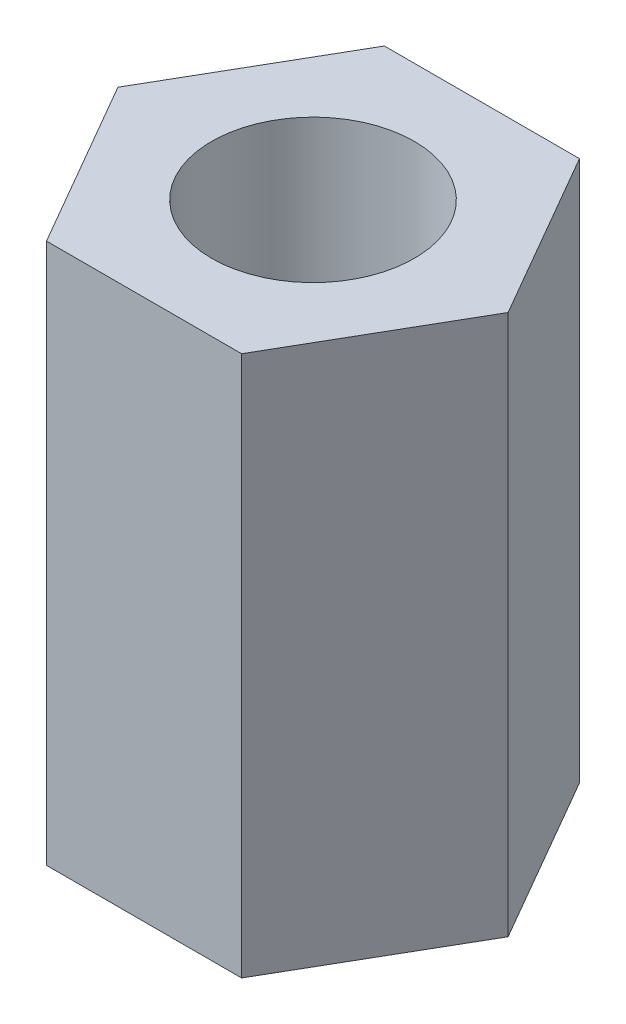
ISO-10303-21;
HEADER;
FILE_DESCRIPTION(('STEP AP214'),'2;1');
FILE_NAME('part.step','',(''),(''),'','','');
FILE_SCHEMA(('AUTOMOTIVE_DESIGN { 1 0 10303 214 1 1 1 1 }'));
ENDSEC;
DATA;
#1=APPLICATION_CONTEXT('core data for automotive mechanical design processes');
#2=APPLICATION_PROTOCOL_DEFINITION('international standard','automotive_design',2000,#1);
#3=PRODUCT_CONTEXT('',#1,'mechanical');
#4=PRODUCT('Part','Part','',(#3));
#5=PRODUCT_RELATED_PRODUCT_CATEGORY('part','',(#4));
#6=PRODUCT_DEFINITION_FORMATION('','',#4);
#7=PRODUCT_DEFINITION_CONTEXT('part definition',#1,'design');
#8=PRODUCT_DEFINITION('design','',#6,#7);
#9=PRODUCT_DEFINITION_SHAPE('','',#8);
#10=(LENGTH_UNIT() NAMED_UNIT(*) SI_UNIT(.MILLI.,.METRE.));
#11=(NAMED_UNIT(*) PLANE_ANGLE_UNIT() SI_UNIT($,.RADIAN.));
#12=(NAMED_UNIT(*) SI_UNIT($,.STERADIAN.) SOLID_ANGLE_UNIT());
#13=UNCERTAINTY_MEASURE_WITH_UNIT(LENGTH_MEASURE(1.E-05),#10,'distance_accuracy_value','');
#14=(GEOMETRIC_REPRESENTATION_CONTEXT(3) GLOBAL_UNCERTAINTY_ASSIGNED_CONTEXT((#13)) GLOBAL_UNIT_ASSIGNED_CONTEXT((#10,
#11,#12)) REPRESENTATION_CONTEXT('',''));
#15=CARTESIAN_POINT('',(0.,0.,0.));
#16=DIRECTION('',(0.,0.,1.));
#17=DIRECTION('',(1.,0.,0.));
#18=AXIS2_PLACEMENT_3D('',#15,#16,#17);
#19=CARTESIAN_POINT('',(0.,8.,2.5));
#20=DIRECTION('',(0.,0.,-1.));
#21=DIRECTION('',(-1.,0.,0.));
#22=AXIS2_PLACEMENT_3D('',#19,#20,#21);
#23=PLANE('',#22);
#24=DIRECTION('',(1.,0.,0.));
#25=VECTOR('',#24,1.);
#26=CARTESIAN_POINT('',(0.,0.,2.5));
#27=LINE('',#26,#25);
#28=CARTESIAN_POINT('',(-1.44337567297404,0.,2.50000000000001));
#29=VERTEX_POINT('',#28);
#30=CARTESIAN_POINT('',(1.44337567297409,0.,2.49999999999998));
#31=VERTEX_POINT('',#30);
#32=EDGE_CURVE('E122',#29,#31,#27,.T.);
#33=ORIENTED_EDGE('',*,*,#32,.T.);
#34=DIRECTION('',(0.,-1.,0.));
#35=VECTOR('',#34,1.);
#36=CARTESIAN_POINT('',(1.44337567297409,8.,2.49999999999998));
#37=LINE('',#36,#35);
#38=CARTESIAN_POINT('',(1.44337567297409,8.,2.49999999999998));
#39=VERTEX_POINT('',#38);
#40=EDGE_CURVE('E11',#39,#31,#37,.T.);
#41=ORIENTED_EDGE('',*,*,#40,.F.);
#42=DIRECTION('',(1.,0.,0.));
#43=VECTOR('',#42,1.);
#44=CARTESIAN_POINT('',(0.,8.,2.5));
#45=LINE('',#44,#43);
#46=CARTESIAN_POINT('',(-1.44337567297404,8.,2.50000000000001));
#47=VERTEX_POINT('',#46);
#48=EDGE_CURVE('E145',#47,#39,#45,.T.);
#49=ORIENTED_EDGE('',*,*,#48,.F.);
#50=DIRECTION('',(0.,-1.,0.));
#51=VECTOR('',#50,1.);
#52=CARTESIAN_POINT('',(-1.44337567297404,8.,2.50000000000001));
#53=LINE('',#52,#51);
#54=EDGE_CURVE('E115',#47,#29,#53,.T.);
#55=ORIENTED_EDGE('',*,*,#54,.T.);
#56=EDGE_LOOP('',(#33,#41,#49,#55));
#57=FACE_BOUND('',#56,.T.);
#58=ADVANCED_FACE('F34',(#57),#23,.F.);
#59=CARTESIAN_POINT('',(2.16506350946111,8.,1.24999999999999));
#60=DIRECTION('',(-0.866025403784442,0.,-0.499999999999995));
#61=DIRECTION('',(-0.499999999999995,0.,0.866025403784442));
#62=AXIS2_PLACEMENT_3D('',#59,#60,#61);
#63=PLANE('',#62);
#64=DIRECTION('',(0.499999999999995,0.,-0.866025403784442));
#65=VECTOR('',#64,1.);
#66=CARTESIAN_POINT('',(2.16506350946111,0.,1.24999999999999));
#67=LINE('',#66,#65);
#68=CARTESIAN_POINT('',(2.88675134594813,0.,0.));
#69=VERTEX_POINT('',#68);
#70=EDGE_CURVE('E125',#31,#69,#67,.T.);
#71=ORIENTED_EDGE('',*,*,#70,.T.);
#72=DIRECTION('',(0.,-1.,0.));
#73=VECTOR('',#72,1.);
#74=CARTESIAN_POINT('',(2.88675134594813,8.,0.));
#75=LINE('',#74,#73);
#76=CARTESIAN_POINT('',(2.88675134594813,8.,0.));
#77=VERTEX_POINT('',#76);
#78=EDGE_CURVE('E43',#77,#69,#75,.T.);
#79=ORIENTED_EDGE('',*,*,#78,.F.);
#80=DIRECTION('',(0.499999999999995,0.,-0.866025403784442));
#81=VECTOR('',#80,1.);
#82=CARTESIAN_POINT('',(2.16506350946111,8.,1.24999999999999));
#83=LINE('',#82,#81);
#84=EDGE_CURVE('E88',#39,#77,#83,.T.);
#85=ORIENTED_EDGE('',*,*,#84,.F.);
#86=ORIENTED_EDGE('',*,*,#40,.T.);
#87=EDGE_LOOP('',(#71,#79,#85,#86));
#88=FACE_BOUND('',#87,.T.);
#89=ADVANCED_FACE('F159',(#88),#63,.F.);
#90=CARTESIAN_POINT('',(2.1650635094611,8.,-1.25));
#91=DIRECTION('',(-0.866025403784438,0.,0.500000000000001));
#92=DIRECTION('',(0.500000000000001,0.,0.866025403784438));
#93=AXIS2_PLACEMENT_3D('',#90,#91,#92);
#94=PLANE('',#93);
#95=DIRECTION('',(-0.500000000000001,0.,-0.866025403784438));
#96=VECTOR('',#95,1.);
#97=CARTESIAN_POINT('',(2.1650635094611,0.,-1.25));
#98=LINE('',#97,#96);
#99=CARTESIAN_POINT('',(1.44337567297406,0.,-2.5));
#100=VERTEX_POINT('',#99);
#101=EDGE_CURVE('E127',#69,#100,#98,.T.);
#102=ORIENTED_EDGE('',*,*,#101,.T.);
#103=DIRECTION('',(0.,-1.,0.));
#104=VECTOR('',#103,1.);
#105=CARTESIAN_POINT('',(1.44337567297406,8.,-2.5));
#106=LINE('',#105,#104);
#107=CARTESIAN_POINT('',(1.44337567297406,8.,-2.5));
#108=VERTEX_POINT('',#107);
#109=EDGE_CURVE('E110',#108,#100,#106,.T.);
#110=ORIENTED_EDGE('',*,*,#109,.F.);
#111=DIRECTION('',(-0.500000000000001,0.,-0.866025403784438));
#112=VECTOR('',#111,1.);
#113=CARTESIAN_POINT('',(2.1650635094611,8.,-1.25));
#114=LINE('',#113,#112);
#115=EDGE_CURVE('E101',#77,#108,#114,.T.);
#116=ORIENTED_EDGE('',*,*,#115,.F.);
#117=ORIENTED_EDGE('',*,*,#78,.T.);
#118=EDGE_LOOP('',(#102,#110,#116,#117));
#119=FACE_BOUND('',#118,.T.);
#120=ADVANCED_FACE('F138',(#119),#94,.F.);
#121=CARTESIAN_POINT('',(0.,8.,-2.5));
#122=DIRECTION('',(0.,0.,1.));
#123=DIRECTION('',(1.,0.,0.));
#124=AXIS2_PLACEMENT_3D('',#121,#122,#123);
#125=PLANE('',#124);
#126=DIRECTION('',(-1.,0.,0.));
#127=VECTOR('',#126,1.);
#128=CARTESIAN_POINT('',(0.,0.,-2.5));
#129=LINE('',#128,#127);
#130=CARTESIAN_POINT('',(-1.44337567297408,0.,-2.49999999999999));
#131=VERTEX_POINT('',#130);
#132=EDGE_CURVE('E109',#100,#131,#129,.T.);
#133=ORIENTED_EDGE('',*,*,#132,.T.);
#134=DIRECTION('',(0.,-1.,0.));
#135=VECTOR('',#134,1.);
#136=CARTESIAN_POINT('',(-1.44337567297408,8.,-2.49999999999999));
#137=LINE('',#136,#135);
#138=CARTESIAN_POINT('',(-1.44337567297408,8.,-2.49999999999999));
#139=VERTEX_POINT('',#138);
#140=EDGE_CURVE('E106',#139,#131,#137,.T.);
#141=ORIENTED_EDGE('',*,*,#140,.F.);
#142=DIRECTION('',(-1.,0.,0.));
#143=VECTOR('',#142,1.);
#144=CARTESIAN_POINT('',(0.,8.,-2.5));
#145=LINE('',#144,#143);
#146=EDGE_CURVE('E95',#108,#139,#145,.T.);
#147=ORIENTED_EDGE('',*,*,#146,.F.);
#148=ORIENTED_EDGE('',*,*,#109,.T.);
#149=EDGE_LOOP('',(#133,#141,#147,#148));
#150=FACE_BOUND('',#149,.T.);
#151=ADVANCED_FACE('F107',(#150),#125,.F.);
#152=CARTESIAN_POINT('',(-2.1650635094611,8.,-1.24999999999999));
#153=DIRECTION('',(0.866025403784441,0.,0.499999999999995));
#154=DIRECTION('',(0.499999999999995,0.,-0.866025403784442));
#155=AXIS2_PLACEMENT_3D('',#152,#153,#154);
#156=PLANE('',#155);
#157=DIRECTION('',(-0.499999999999995,0.,0.866025403784441));
#158=VECTOR('',#157,1.);
#159=CARTESIAN_POINT('',(-2.1650635094611,0.,-1.24999999999999));
#160=LINE('',#159,#158);
#161=CARTESIAN_POINT('',(-2.88675134594813,0.,0.));
#162=VERTEX_POINT('',#161);
#163=EDGE_CURVE('E74',#131,#162,#160,.T.);
#164=ORIENTED_EDGE('',*,*,#163,.T.);
#165=DIRECTION('',(0.,-1.,0.));
#166=VECTOR('',#165,1.);
#167=CARTESIAN_POINT('',(-2.88675134594813,8.,0.));
#168=LINE('',#167,#166);
#169=CARTESIAN_POINT('',(-2.88675134594813,8.,0.));
#170=VERTEX_POINT('',#169);
#171=EDGE_CURVE('E111',#170,#162,#168,.T.);
#172=ORIENTED_EDGE('',*,*,#171,.F.);
#173=DIRECTION('',(-0.499999999999995,0.,0.866025403784441));
#174=VECTOR('',#173,1.);
#175=CARTESIAN_POINT('',(-2.1650635094611,8.,-1.24999999999999));
#176=LINE('',#175,#174);
#177=EDGE_CURVE('E99',#139,#170,#176,.T.);
#178=ORIENTED_EDGE('',*,*,#177,.F.);
#179=ORIENTED_EDGE('',*,*,#140,.T.);
#180=EDGE_LOOP('',(#164,#172,#178,#179));
#181=FACE_BOUND('',#180,.T.);
#182=ADVANCED_FACE('F113',(#181),#156,.F.);
#183=CARTESIAN_POINT('',(0.,8.,0.));
#184=DIRECTION('',(0.,-1.,0.));
#185=DIRECTION('',(0.,0.,-1.));
#186=AXIS2_PLACEMENT_3D('',#183,#184,#185);
#187=CYLINDRICAL_SURFACE('',#186,1.5);
#188=CARTESIAN_POINT('',(0.,8.,0.));
#189=DIRECTION('',(0.,1.,0.));
#190=DIRECTION('',(0.,0.,1.));
#191=AXIS2_PLACEMENT_3D('',#188,#189,#190);
#192=CIRCLE('',#191,1.5);
#193=CARTESIAN_POINT('',(0.,8.,1.5));
#194=VERTEX_POINT('',#193);
#195=EDGE_CURVE('E132',#194,#194,#192,.T.);
#196=ORIENTED_EDGE('',*,*,#195,.T.);
#197=EDGE_LOOP('',(#196));
#198=FACE_BOUND('',#197,.T.);
#199=CARTESIAN_POINT('',(0.,0.,0.));
#200=DIRECTION('',(0.,1.,0.));
#201=DIRECTION('',(0.,0.,1.));
#202=AXIS2_PLACEMENT_3D('',#199,#200,#201);
#203=CIRCLE('',#202,1.5);
#204=CARTESIAN_POINT('',(0.,0.,1.5));
#205=VERTEX_POINT('',#204);
#206=EDGE_CURVE('E119',#205,#205,#203,.T.);
#207=ORIENTED_EDGE('',*,*,#206,.F.);
#208=EDGE_LOOP('',(#207));
#209=FACE_BOUND('',#208,.T.);
#210=ADVANCED_FACE('F36',(#198,#209),#187,.F.);
#211=CARTESIAN_POINT('',(-2.16506350946109,8.,1.25000000000002));
#212=DIRECTION('',(0.866025403784435,0.,-0.500000000000007));
#213=DIRECTION('',(-0.500000000000007,0.,-0.866025403784435));
#214=AXIS2_PLACEMENT_3D('',#211,#212,#213);
#215=PLANE('',#214);
#216=DIRECTION('',(0.500000000000007,0.,0.866025403784435));
#217=VECTOR('',#216,1.);
#218=CARTESIAN_POINT('',(-2.16506350946109,0.,1.25000000000002));
#219=LINE('',#218,#217);
#220=EDGE_CURVE('E80',#162,#29,#219,.T.);
#221=ORIENTED_EDGE('',*,*,#220,.T.);
#222=ORIENTED_EDGE('',*,*,#54,.F.);
#223=DIRECTION('',(0.500000000000007,0.,0.866025403784435));
#224=VECTOR('',#223,1.);
#225=CARTESIAN_POINT('',(-2.16506350946109,8.,1.25000000000002));
#226=LINE('',#225,#224);
#227=EDGE_CURVE('E51',#170,#47,#226,.T.);
#228=ORIENTED_EDGE('',*,*,#227,.F.);
#229=ORIENTED_EDGE('',*,*,#171,.T.);
#230=EDGE_LOOP('',(#221,#222,#228,#229));
#231=FACE_BOUND('',#230,.T.);
#232=ADVANCED_FACE('F146',(#231),#215,.F.);
#233=CARTESIAN_POINT('',(0.,8.,0.));
#234=DIRECTION('',(0.,1.,0.));
#235=DIRECTION('',(0.,0.,1.));
#236=AXIS2_PLACEMENT_3D('',#233,#234,#235);
#237=PLANE('',#236);
#238=ORIENTED_EDGE('',*,*,#195,.F.);
#239=EDGE_LOOP('',(#238));
#240=FACE_BOUND('',#239,.T.);
#241=ORIENTED_EDGE('',*,*,#48,.T.);
#242=ORIENTED_EDGE('',*,*,#84,.T.);
#243=ORIENTED_EDGE('',*,*,#115,.T.);
#244=ORIENTED_EDGE('',*,*,#146,.T.);
#245=ORIENTED_EDGE('',*,*,#177,.T.);
#246=ORIENTED_EDGE('',*,*,#227,.T.);
#247=EDGE_LOOP('',(#241,#242,#243,#244,#245,#246));
#248=FACE_BOUND('',#247,.T.);
#249=ADVANCED_FACE('F97',(#240,#248),#237,.T.);
#250=CARTESIAN_POINT('',(0.,0.,0.));
#251=DIRECTION('',(0.,1.,0.));
#252=DIRECTION('',(0.,0.,1.));
#253=AXIS2_PLACEMENT_3D('',#250,#251,#252);
#254=PLANE('',#253);
#255=ORIENTED_EDGE('',*,*,#206,.T.);
#256=EDGE_LOOP('',(#255));
#257=FACE_BOUND('',#256,.T.);
#258=ORIENTED_EDGE('',*,*,#32,.F.);
#259=ORIENTED_EDGE('',*,*,#220,.F.);
#260=ORIENTED_EDGE('',*,*,#163,.F.);
#261=ORIENTED_EDGE('',*,*,#132,.F.);
#262=ORIENTED_EDGE('',*,*,#101,.F.);
#263=ORIENTED_EDGE('',*,*,#70,.F.);
#264=EDGE_LOOP('',(#258,#259,#260,#261,#262,#263));
#265=FACE_BOUND('',#264,.T.);
#266=ADVANCED_FACE('F141',(#257,#265),#254,.F.);
#267=CLOSED_SHELL('',(#58,#89,#120,#151,#182,#210,#232,#249,#266));
#268=MANIFOLD_SOLID_BREP('B2',#267);
#269=ADVANCED_BREP_SHAPE_REPRESENTATION('',(#18,#268),#14);
#270=SHAPE_DEFINITION_REPRESENTATION(#9,#269);
ENDSEC;
END-ISO-10303-21;
